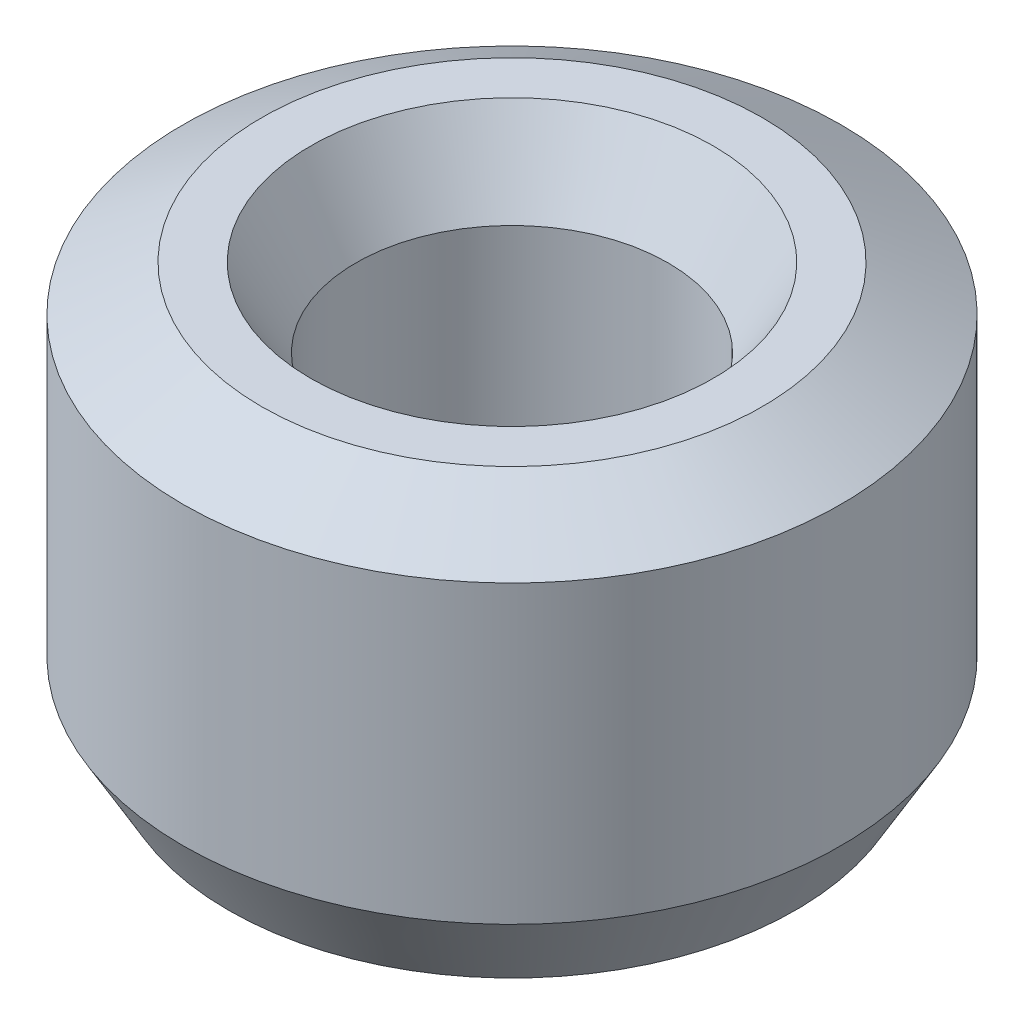
ISO-10303-21;
HEADER;
FILE_DESCRIPTION(('STEP AP214'),'2;1');
FILE_NAME('part.step','',(''),(''),'','','');
FILE_SCHEMA(('AUTOMOTIVE_DESIGN { 1 0 10303 214 1 1 1 1 }'));
ENDSEC;
DATA;
#1=APPLICATION_CONTEXT('core data for automotive mechanical design processes');
#2=APPLICATION_PROTOCOL_DEFINITION('international standard','automotive_design',2000,#1);
#3=PRODUCT_CONTEXT('',#1,'mechanical');
#4=PRODUCT('Part','Part','',(#3));
#5=PRODUCT_RELATED_PRODUCT_CATEGORY('part','',(#4));
#6=PRODUCT_DEFINITION_FORMATION('','',#4);
#7=PRODUCT_DEFINITION_CONTEXT('part definition',#1,'design');
#8=PRODUCT_DEFINITION('design','',#6,#7);
#9=PRODUCT_DEFINITION_SHAPE('','',#8);
#10=(LENGTH_UNIT() NAMED_UNIT(*) SI_UNIT(.MILLI.,.METRE.));
#11=(NAMED_UNIT(*) PLANE_ANGLE_UNIT() SI_UNIT($,.RADIAN.));
#12=(NAMED_UNIT(*) SI_UNIT($,.STERADIAN.) SOLID_ANGLE_UNIT());
#13=UNCERTAINTY_MEASURE_WITH_UNIT(LENGTH_MEASURE(1.E-05),#10,'distance_accuracy_value','');
#14=(GEOMETRIC_REPRESENTATION_CONTEXT(3) GLOBAL_UNCERTAINTY_ASSIGNED_CONTEXT((#13)) GLOBAL_UNIT_ASSIGNED_CONTEXT((#10,
#11,#12)) REPRESENTATION_CONTEXT('',''));
#15=CARTESIAN_POINT('',(0.,0.,0.));
#16=DIRECTION('',(0.,0.,1.));
#17=DIRECTION('',(1.,0.,0.));
#18=AXIS2_PLACEMENT_3D('',#15,#16,#17);
#19=CARTESIAN_POINT('',(0.,12.7550460516342,0.));
#20=DIRECTION('',(0.,-1.,0.));
#21=DIRECTION('',(0.,0.,-1.));
#22=AXIS2_PLACEMENT_3D('',#19,#20,#21);
#23=CYLINDRICAL_SURFACE('',#22,10.);
#24=CARTESIAN_POINT('',(0.,2.38807393391805,0.));
#25=DIRECTION('',(0.,1.,0.));
#26=DIRECTION('',(0.,0.,1.));
#27=AXIS2_PLACEMENT_3D('',#24,#25,#26);
#28=CIRCLE('',#27,10.);
#29=CARTESIAN_POINT('',(0.,2.38807393391805,10.));
#30=VERTEX_POINT('',#29);
#31=EDGE_CURVE('E10',#30,#30,#28,.T.);
#32=ORIENTED_EDGE('',*,*,#31,.T.);
#33=EDGE_LOOP('',(#32));
#34=FACE_BOUND('',#33,.T.);
#35=CARTESIAN_POINT('',(0.,11.3762909230419,0.));
#36=DIRECTION('',(0.,1.,0.));
#37=DIRECTION('',(0.,0.,1.));
#38=AXIS2_PLACEMENT_3D('',#35,#36,#37);
#39=CIRCLE('',#38,10.);
#40=CARTESIAN_POINT('',(0.,11.3762909230419,10.));
#41=VERTEX_POINT('',#40);
#42=EDGE_CURVE('E50',#41,#41,#39,.F.);
#43=ORIENTED_EDGE('',*,*,#42,.T.);
#44=EDGE_LOOP('',(#43));
#45=FACE_BOUND('',#44,.T.);
#46=ADVANCED_FACE('F39',(#34,#45),#23,.T.);
#47=CARTESIAN_POINT('',(0.,12.7550460516342,0.));
#48=DIRECTION('',(0.,1.,0.));
#49=DIRECTION('',(0.,0.,1.));
#50=AXIS2_PLACEMENT_3D('',#47,#48,#49);
#51=PLANE('',#50);
#52=CARTESIAN_POINT('',(0.,12.7550460516342,0.));
#53=DIRECTION('',(0.,1.,0.));
#54=DIRECTION('',(0.,0.,1.));
#55=AXIS2_PLACEMENT_3D('',#52,#53,#54);
#56=CIRCLE('',#55,6.12248405532632);
#57=CARTESIAN_POINT('',(0.,12.7550460516342,6.12248405532632));
#58=VERTEX_POINT('',#57);
#59=EDGE_CURVE('E58',#58,#58,#56,.F.);
#60=ORIENTED_EDGE('',*,*,#59,.T.);
#61=EDGE_LOOP('',(#60));
#62=FACE_BOUND('',#61,.T.);
#63=CARTESIAN_POINT('',(0.,12.7550460516342,0.));
#64=DIRECTION('',(0.,1.,0.));
#65=DIRECTION('',(0.,0.,1.));
#66=AXIS2_PLACEMENT_3D('',#63,#64,#65);
#67=CIRCLE('',#66,7.61192606608196);
#68=CARTESIAN_POINT('',(0.,12.7550460516342,7.61192606608196));
#69=VERTEX_POINT('',#68);
#70=EDGE_CURVE('E61',#69,#69,#67,.T.);
#71=ORIENTED_EDGE('',*,*,#70,.T.);
#72=EDGE_LOOP('',(#71));
#73=FACE_BOUND('',#72,.T.);
#74=ADVANCED_FACE('F88',(#62,#73),#51,.T.);
#75=CARTESIAN_POINT('',(0.,0.,0.));
#76=DIRECTION('',(0.,1.,0.));
#77=DIRECTION('',(0.,0.,1.));
#78=AXIS2_PLACEMENT_3D('',#75,#76,#77);
#79=PLANE('',#78);
#80=CARTESIAN_POINT('',(0.,0.,0.));
#81=DIRECTION('',(0.,1.,0.));
#82=DIRECTION('',(0.,0.,1.));
#83=AXIS2_PLACEMENT_3D('',#80,#81,#82);
#84=CIRCLE('',#83,7.13180286065202);
#85=CARTESIAN_POINT('',(0.,0.,7.13180286065202));
#86=VERTEX_POINT('',#85);
#87=EDGE_CURVE('E51',#86,#86,#84,.T.);
#88=ORIENTED_EDGE('',*,*,#87,.T.);
#89=EDGE_LOOP('',(#88));
#90=FACE_BOUND('',#89,.T.);
#91=CARTESIAN_POINT('',(0.,0.,0.));
#92=DIRECTION('',(0.,1.,0.));
#93=DIRECTION('',(0.,0.,1.));
#94=AXIS2_PLACEMENT_3D('',#91,#92,#93);
#95=CIRCLE('',#94,8.62124487140768);
#96=CARTESIAN_POINT('',(0.,0.,8.62124487140768));
#97=VERTEX_POINT('',#96);
#98=EDGE_CURVE('E54',#97,#97,#95,.F.);
#99=ORIENTED_EDGE('',*,*,#98,.T.);
#100=EDGE_LOOP('',(#99));
#101=FACE_BOUND('',#100,.T.);
#102=ADVANCED_FACE('F83',(#90,#101),#79,.F.);
#103=CARTESIAN_POINT('',(0.,12.7550460516342,0.));
#104=DIRECTION('',(0.,-1.,0.));
#105=DIRECTION('',(0.,0.,-1.));
#106=AXIS2_PLACEMENT_3D('',#103,#104,#105);
#107=CYLINDRICAL_SURFACE('',#106,4.74372892673398);
#108=CARTESIAN_POINT('',(0.,10.3669721177161,0.));
#109=DIRECTION('',(0.,1.,0.));
#110=DIRECTION('',(0.,0.,1.));
#111=AXIS2_PLACEMENT_3D('',#108,#109,#110);
#112=CIRCLE('',#111,4.74372892673398);
#113=CARTESIAN_POINT('',(0.,10.3669721177161,4.74372892673398));
#114=VERTEX_POINT('',#113);
#115=EDGE_CURVE('E67',#114,#114,#112,.T.);
#116=ORIENTED_EDGE('',*,*,#115,.T.);
#117=EDGE_LOOP('',(#116));
#118=FACE_BOUND('',#117,.T.);
#119=CARTESIAN_POINT('',(0.,1.37875512859232,0.));
#120=DIRECTION('',(0.,1.,0.));
#121=DIRECTION('',(0.,0.,1.));
#122=AXIS2_PLACEMENT_3D('',#119,#120,#121);
#123=CIRCLE('',#122,4.74372892673398);
#124=CARTESIAN_POINT('',(0.,1.37875512859232,4.74372892673398));
#125=VERTEX_POINT('',#124);
#126=EDGE_CURVE('E69',#125,#125,#123,.F.);
#127=ORIENTED_EDGE('',*,*,#126,.T.);
#128=EDGE_LOOP('',(#127));
#129=FACE_BOUND('',#128,.T.);
#130=ADVANCED_FACE('F71',(#118,#129),#107,.F.);
#131=CARTESIAN_POINT('',(0.,10.3669721177161,0.));
#132=DIRECTION('',(0.,1.,0.));
#133=DIRECTION('',(0.,0.,1.));
#134=AXIS2_PLACEMENT_3D('',#131,#132,#133);
#135=CONICAL_SURFACE('',#134,4.74372892673398,0.523598775598303);
#136=ORIENTED_EDGE('',*,*,#59,.F.);
#137=EDGE_LOOP('',(#136));
#138=FACE_BOUND('',#137,.T.);
#139=ORIENTED_EDGE('',*,*,#115,.F.);
#140=EDGE_LOOP('',(#139));
#141=FACE_BOUND('',#140,.T.);
#142=ADVANCED_FACE('F77',(#138,#141),#135,.F.);
#143=CARTESIAN_POINT('',(0.,0.,0.));
#144=DIRECTION('',(0.,-1.,0.));
#145=DIRECTION('',(0.,0.,-1.));
#146=AXIS2_PLACEMENT_3D('',#143,#144,#145);
#147=CONICAL_SURFACE('',#146,7.13180286065202,1.04719755119659);
#148=ORIENTED_EDGE('',*,*,#126,.F.);
#149=EDGE_LOOP('',(#148));
#150=FACE_BOUND('',#149,.T.);
#151=ORIENTED_EDGE('',*,*,#87,.F.);
#152=EDGE_LOOP('',(#151));
#153=FACE_BOUND('',#152,.T.);
#154=ADVANCED_FACE('F73',(#150,#153),#147,.F.);
#155=CARTESIAN_POINT('',(0.,2.38807393391805,0.));
#156=DIRECTION('',(0.,1.,0.));
#157=DIRECTION('',(0.,0.,1.));
#158=AXIS2_PLACEMENT_3D('',#155,#156,#157);
#159=CONICAL_SURFACE('',#158,10.,0.523598775598303);
#160=ORIENTED_EDGE('',*,*,#98,.F.);
#161=EDGE_LOOP('',(#160));
#162=FACE_BOUND('',#161,.T.);
#163=ORIENTED_EDGE('',*,*,#31,.F.);
#164=EDGE_LOOP('',(#163));
#165=FACE_BOUND('',#164,.T.);
#166=ADVANCED_FACE('F76',(#162,#165),#159,.T.);
#167=CARTESIAN_POINT('',(0.,12.7550460516342,0.));
#168=DIRECTION('',(0.,-1.,0.));
#169=DIRECTION('',(0.,0.,-1.));
#170=AXIS2_PLACEMENT_3D('',#167,#168,#169);
#171=CONICAL_SURFACE('',#170,7.61192606608196,1.0471975511966);
#172=ORIENTED_EDGE('',*,*,#42,.F.);
#173=EDGE_LOOP('',(#172));
#174=FACE_BOUND('',#173,.T.);
#175=ORIENTED_EDGE('',*,*,#70,.F.);
#176=EDGE_LOOP('',(#175));
#177=FACE_BOUND('',#176,.T.);
#178=ADVANCED_FACE('F45',(#174,#177),#171,.T.);
#179=CLOSED_SHELL('',(#46,#74,#102,#130,#142,#154,#166,#178));
#180=MANIFOLD_SOLID_BREP('B2',#179);
#181=ADVANCED_BREP_SHAPE_REPRESENTATION('',(#18,#180),#14);
#182=SHAPE_DEFINITION_REPRESENTATION(#9,#181);
ENDSEC;
END-ISO-10303-21;
